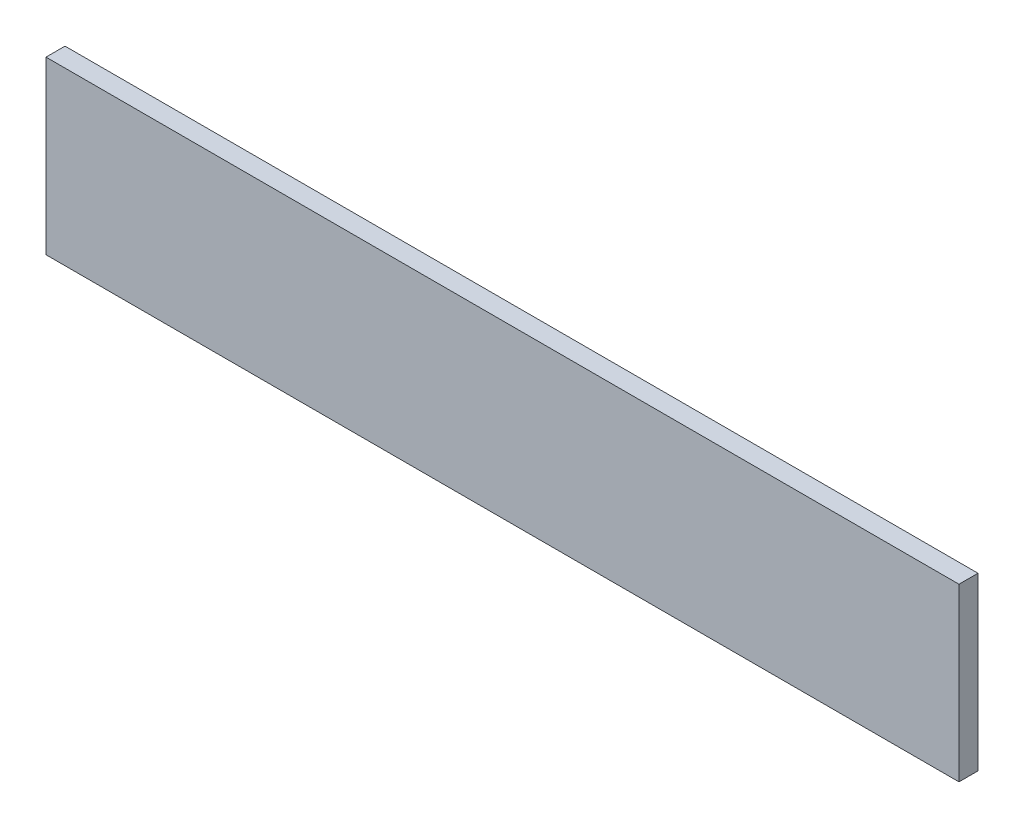
ISO-10303-21;
HEADER;
FILE_DESCRIPTION(('STEP AP214'),'2;1');
FILE_NAME('part.step','',(''),(''),'','','');
FILE_SCHEMA(('AUTOMOTIVE_DESIGN { 1 0 10303 214 1 1 1 1 }'));
ENDSEC;
DATA;
#1=APPLICATION_CONTEXT('core data for automotive mechanical design processes');
#2=APPLICATION_PROTOCOL_DEFINITION('international standard','automotive_design',2000,#1);
#3=PRODUCT_CONTEXT('',#1,'mechanical');
#4=PRODUCT('Part','Part','',(#3));
#5=PRODUCT_RELATED_PRODUCT_CATEGORY('part','',(#4));
#6=PRODUCT_DEFINITION_FORMATION('','',#4);
#7=PRODUCT_DEFINITION_CONTEXT('part definition',#1,'design');
#8=PRODUCT_DEFINITION('design','',#6,#7);
#9=PRODUCT_DEFINITION_SHAPE('','',#8);
#10=(LENGTH_UNIT() NAMED_UNIT(*) SI_UNIT(.MILLI.,.METRE.));
#11=(NAMED_UNIT(*) PLANE_ANGLE_UNIT() SI_UNIT($,.RADIAN.));
#12=(NAMED_UNIT(*) SI_UNIT($,.STERADIAN.) SOLID_ANGLE_UNIT());
#13=UNCERTAINTY_MEASURE_WITH_UNIT(LENGTH_MEASURE(1.E-05),#10,'distance_accuracy_value','');
#14=(GEOMETRIC_REPRESENTATION_CONTEXT(3) GLOBAL_UNCERTAINTY_ASSIGNED_CONTEXT((#13)) GLOBAL_UNIT_ASSIGNED_CONTEXT((#10,
#11,#12)) REPRESENTATION_CONTEXT('',''));
#15=CARTESIAN_POINT('',(0.,0.,0.));
#16=DIRECTION('',(0.,0.,1.));
#17=DIRECTION('',(1.,0.,0.));
#18=AXIS2_PLACEMENT_3D('',#15,#16,#17);
#19=CARTESIAN_POINT('',(304.8,-57.15,12.7));
#20=DIRECTION('',(-1.,0.,0.));
#21=DIRECTION('',(0.,0.,1.));
#22=AXIS2_PLACEMENT_3D('',#19,#20,#21);
#23=PLANE('',#22);
#24=DIRECTION('',(0.,1.,0.));
#25=VECTOR('',#24,1.);
#26=CARTESIAN_POINT('',(304.8,-57.15,0.));
#27=LINE('',#26,#25);
#28=CARTESIAN_POINT('',(304.8,-57.15,0.));
#29=VERTEX_POINT('',#28);
#30=CARTESIAN_POINT('',(304.8,57.15,0.));
#31=VERTEX_POINT('',#30);
#32=EDGE_CURVE('E96',#29,#31,#27,.T.);
#33=ORIENTED_EDGE('',*,*,#32,.T.);
#34=DIRECTION('',(0.,0.,-1.));
#35=VECTOR('',#34,1.);
#36=CARTESIAN_POINT('',(304.8,57.15,12.7));
#37=LINE('',#36,#35);
#38=CARTESIAN_POINT('',(304.8,57.15,12.7));
#39=VERTEX_POINT('',#38);
#40=EDGE_CURVE('E11',#39,#31,#37,.T.);
#41=ORIENTED_EDGE('',*,*,#40,.F.);
#42=DIRECTION('',(0.,1.,0.));
#43=VECTOR('',#42,1.);
#44=CARTESIAN_POINT('',(304.8,-57.15,12.7));
#45=LINE('',#44,#43);
#46=CARTESIAN_POINT('',(304.8,-57.15,12.7));
#47=VERTEX_POINT('',#46);
#48=EDGE_CURVE('E84',#47,#39,#45,.T.);
#49=ORIENTED_EDGE('',*,*,#48,.F.);
#50=DIRECTION('',(0.,0.,-1.));
#51=VECTOR('',#50,1.);
#52=CARTESIAN_POINT('',(304.8,-57.15,12.7));
#53=LINE('',#52,#51);
#54=EDGE_CURVE('E92',#47,#29,#53,.T.);
#55=ORIENTED_EDGE('',*,*,#54,.T.);
#56=EDGE_LOOP('',(#33,#41,#49,#55));
#57=FACE_BOUND('',#56,.T.);
#58=ADVANCED_FACE('F33',(#57),#23,.F.);
#59=CARTESIAN_POINT('',(-304.8,57.15,12.7));
#60=DIRECTION('',(0.,-1.,0.));
#61=DIRECTION('',(0.,0.,-1.));
#62=AXIS2_PLACEMENT_3D('',#59,#60,#61);
#63=PLANE('',#62);
#64=DIRECTION('',(-1.,0.,0.));
#65=VECTOR('',#64,1.);
#66=CARTESIAN_POINT('',(-304.8,57.15,0.));
#67=LINE('',#66,#65);
#68=CARTESIAN_POINT('',(-304.8,57.15,0.));
#69=VERTEX_POINT('',#68);
#70=EDGE_CURVE('E88',#31,#69,#67,.T.);
#71=ORIENTED_EDGE('',*,*,#70,.T.);
#72=DIRECTION('',(0.,0.,-1.));
#73=VECTOR('',#72,1.);
#74=CARTESIAN_POINT('',(-304.8,57.15,12.7));
#75=LINE('',#74,#73);
#76=CARTESIAN_POINT('',(-304.8,57.15,12.7));
#77=VERTEX_POINT('',#76);
#78=EDGE_CURVE('E41',#77,#69,#75,.T.);
#79=ORIENTED_EDGE('',*,*,#78,.F.);
#80=DIRECTION('',(-1.,0.,0.));
#81=VECTOR('',#80,1.);
#82=CARTESIAN_POINT('',(-304.8,57.15,12.7));
#83=LINE('',#82,#81);
#84=EDGE_CURVE('E79',#39,#77,#83,.T.);
#85=ORIENTED_EDGE('',*,*,#84,.F.);
#86=ORIENTED_EDGE('',*,*,#40,.T.);
#87=EDGE_LOOP('',(#71,#79,#85,#86));
#88=FACE_BOUND('',#87,.T.);
#89=ADVANCED_FACE('F87',(#88),#63,.F.);
#90=CARTESIAN_POINT('',(-304.8,-57.15,12.7));
#91=DIRECTION('',(1.,0.,0.));
#92=DIRECTION('',(0.,0.,-1.));
#93=AXIS2_PLACEMENT_3D('',#90,#91,#92);
#94=PLANE('',#93);
#95=DIRECTION('',(0.,-1.,0.));
#96=VECTOR('',#95,1.);
#97=CARTESIAN_POINT('',(-304.8,-57.15,0.));
#98=LINE('',#97,#96);
#99=CARTESIAN_POINT('',(-304.8,-57.15,0.));
#100=VERTEX_POINT('',#99);
#101=EDGE_CURVE('E66',#69,#100,#98,.T.);
#102=ORIENTED_EDGE('',*,*,#101,.T.);
#103=DIRECTION('',(0.,0.,-1.));
#104=VECTOR('',#103,1.);
#105=CARTESIAN_POINT('',(-304.8,-57.15,12.7));
#106=LINE('',#105,#104);
#107=CARTESIAN_POINT('',(-304.8,-57.15,12.7));
#108=VERTEX_POINT('',#107);
#109=EDGE_CURVE('E89',#108,#100,#106,.T.);
#110=ORIENTED_EDGE('',*,*,#109,.F.);
#111=DIRECTION('',(0.,-1.,0.));
#112=VECTOR('',#111,1.);
#113=CARTESIAN_POINT('',(-304.8,-57.15,12.7));
#114=LINE('',#113,#112);
#115=EDGE_CURVE('E82',#77,#108,#114,.T.);
#116=ORIENTED_EDGE('',*,*,#115,.F.);
#117=ORIENTED_EDGE('',*,*,#78,.T.);
#118=EDGE_LOOP('',(#102,#110,#116,#117));
#119=FACE_BOUND('',#118,.T.);
#120=ADVANCED_FACE('F90',(#119),#94,.F.);
#121=CARTESIAN_POINT('',(-304.8,-57.15,12.7));
#122=DIRECTION('',(0.,1.,0.));
#123=DIRECTION('',(0.,0.,1.));
#124=AXIS2_PLACEMENT_3D('',#121,#122,#123);
#125=PLANE('',#124);
#126=DIRECTION('',(1.,0.,0.));
#127=VECTOR('',#126,1.);
#128=CARTESIAN_POINT('',(-304.8,-57.15,0.));
#129=LINE('',#128,#127);
#130=EDGE_CURVE('E72',#100,#29,#129,.T.);
#131=ORIENTED_EDGE('',*,*,#130,.T.);
#132=ORIENTED_EDGE('',*,*,#54,.F.);
#133=DIRECTION('',(1.,0.,0.));
#134=VECTOR('',#133,1.);
#135=CARTESIAN_POINT('',(-304.8,-57.15,12.7));
#136=LINE('',#135,#134);
#137=EDGE_CURVE('E49',#108,#47,#136,.T.);
#138=ORIENTED_EDGE('',*,*,#137,.F.);
#139=ORIENTED_EDGE('',*,*,#109,.T.);
#140=EDGE_LOOP('',(#131,#132,#138,#139));
#141=FACE_BOUND('',#140,.T.);
#142=ADVANCED_FACE('F103',(#141),#125,.F.);
#143=CARTESIAN_POINT('',(0.,0.,12.7));
#144=DIRECTION('',(0.,0.,-1.));
#145=DIRECTION('',(-1.,0.,0.));
#146=AXIS2_PLACEMENT_3D('',#143,#144,#145);
#147=PLANE('',#146);
#148=ORIENTED_EDGE('',*,*,#48,.T.);
#149=ORIENTED_EDGE('',*,*,#84,.T.);
#150=ORIENTED_EDGE('',*,*,#115,.T.);
#151=ORIENTED_EDGE('',*,*,#137,.T.);
#152=EDGE_LOOP('',(#148,#149,#150,#151));
#153=FACE_BOUND('',#152,.T.);
#154=ADVANCED_FACE('F80',(#153),#147,.F.);
#155=CARTESIAN_POINT('',(0.,0.,0.));
#156=DIRECTION('',(0.,0.,-1.));
#157=DIRECTION('',(-1.,0.,0.));
#158=AXIS2_PLACEMENT_3D('',#155,#156,#157);
#159=PLANE('',#158);
#160=ORIENTED_EDGE('',*,*,#32,.F.);
#161=ORIENTED_EDGE('',*,*,#130,.F.);
#162=ORIENTED_EDGE('',*,*,#101,.F.);
#163=ORIENTED_EDGE('',*,*,#70,.F.);
#164=EDGE_LOOP('',(#160,#161,#162,#163));
#165=FACE_BOUND('',#164,.T.);
#166=ADVANCED_FACE('F106',(#165),#159,.T.);
#167=CLOSED_SHELL('',(#58,#89,#120,#142,#154,#166));
#168=MANIFOLD_SOLID_BREP('B2',#167);
#169=ADVANCED_BREP_SHAPE_REPRESENTATION('',(#18,#168),#14);
#170=SHAPE_DEFINITION_REPRESENTATION(#9,#169);
ENDSEC;
END-ISO-10303-21;
